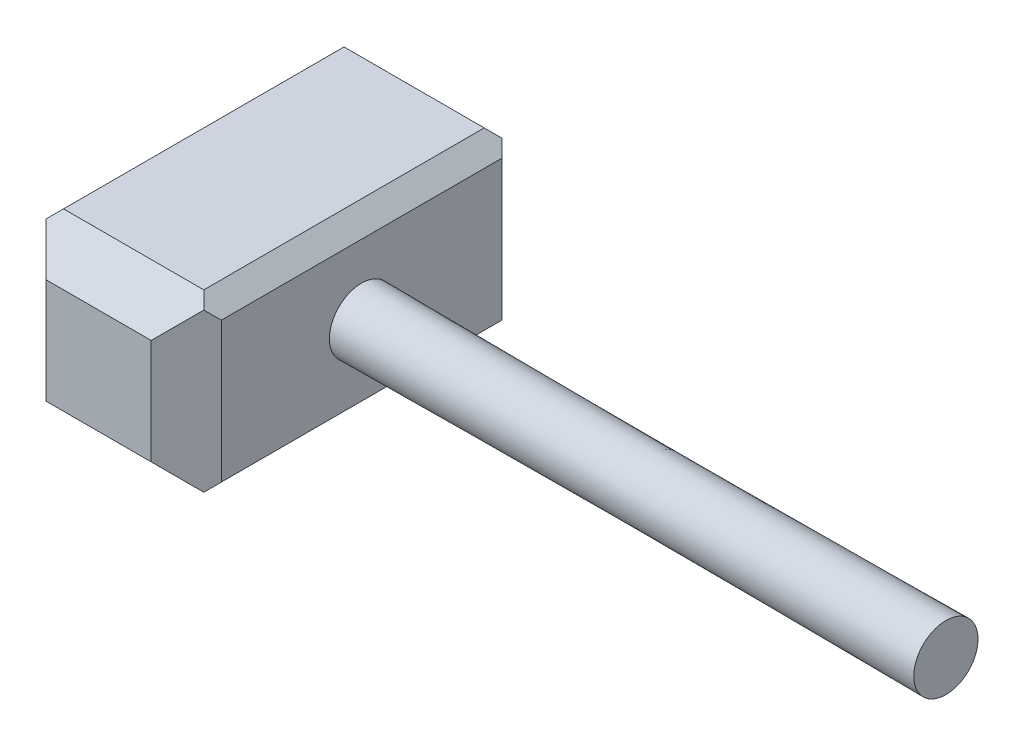
ISO-10303-21;
HEADER;
FILE_DESCRIPTION(('STEP AP214'),'2;1');
FILE_NAME('part.step','',(''),(''),'','','');
FILE_SCHEMA(('AUTOMOTIVE_DESIGN { 1 0 10303 214 1 1 1 1 }'));
ENDSEC;
DATA;
#1=APPLICATION_CONTEXT('core data for automotive mechanical design processes');
#2=APPLICATION_PROTOCOL_DEFINITION('international standard','automotive_design',2000,#1);
#3=PRODUCT_CONTEXT('',#1,'mechanical');
#4=PRODUCT('Part','Part','',(#3));
#5=PRODUCT_RELATED_PRODUCT_CATEGORY('part','',(#4));
#6=PRODUCT_DEFINITION_FORMATION('','',#4);
#7=PRODUCT_DEFINITION_CONTEXT('part definition',#1,'design');
#8=PRODUCT_DEFINITION('design','',#6,#7);
#9=PRODUCT_DEFINITION_SHAPE('','',#8);
#10=(LENGTH_UNIT() NAMED_UNIT(*) SI_UNIT(.MILLI.,.METRE.));
#11=(NAMED_UNIT(*) PLANE_ANGLE_UNIT() SI_UNIT($,.RADIAN.));
#12=(NAMED_UNIT(*) SI_UNIT($,.STERADIAN.) SOLID_ANGLE_UNIT());
#13=UNCERTAINTY_MEASURE_WITH_UNIT(LENGTH_MEASURE(1.E-05),#10,'distance_accuracy_value','');
#14=(GEOMETRIC_REPRESENTATION_CONTEXT(3) GLOBAL_UNCERTAINTY_ASSIGNED_CONTEXT((#13)) GLOBAL_UNIT_ASSIGNED_CONTEXT((#10,
#11,#12)) REPRESENTATION_CONTEXT('',''));
#15=CARTESIAN_POINT('',(0.,0.,0.));
#16=DIRECTION('',(0.,0.,1.));
#17=DIRECTION('',(1.,0.,0.));
#18=AXIS2_PLACEMENT_3D('',#15,#16,#17);
#19=CARTESIAN_POINT('',(150.,0.,0.));
#20=DIRECTION('',(1.,0.,0.));
#21=DIRECTION('',(0.,0.,-1.));
#22=AXIS2_PLACEMENT_3D('',#19,#20,#21);
#23=PLANE('',#22);
#24=DIRECTION('',(0.,1.,0.));
#25=VECTOR('',#24,1.);
#26=CARTESIAN_POINT('',(150.,0.,-120.));
#27=LINE('',#26,#25);
#28=CARTESIAN_POINT('',(150.,-60.0000000000001,-120.));
#29=VERTEX_POINT('',#28);
#30=CARTESIAN_POINT('',(150.,60.0000000000001,-120.));
#31=VERTEX_POINT('',#30);
#32=EDGE_CURVE('E234',#29,#31,#27,.T.);
#33=ORIENTED_EDGE('',*,*,#32,.T.);
#34=DIRECTION('',(0.,0.,1.));
#35=VECTOR('',#34,1.);
#36=CARTESIAN_POINT('',(150.,60.0000000000001,0.));
#37=LINE('',#36,#35);
#38=CARTESIAN_POINT('',(150.,60.0000000000001,120.));
#39=VERTEX_POINT('',#38);
#40=EDGE_CURVE('E239',#31,#39,#37,.T.);
#41=ORIENTED_EDGE('',*,*,#40,.T.);
#42=DIRECTION('',(0.,-1.,0.));
#43=VECTOR('',#42,1.);
#44=CARTESIAN_POINT('',(150.,0.,120.));
#45=LINE('',#44,#43);
#46=CARTESIAN_POINT('',(150.,-60.0000000000001,120.));
#47=VERTEX_POINT('',#46);
#48=EDGE_CURVE('E219',#39,#47,#45,.T.);
#49=ORIENTED_EDGE('',*,*,#48,.T.);
#50=DIRECTION('',(0.,0.,-1.));
#51=VECTOR('',#50,1.);
#52=CARTESIAN_POINT('',(150.,-60.0000000000001,0.));
#53=LINE('',#52,#51);
#54=EDGE_CURVE('E236',#47,#29,#53,.T.);
#55=ORIENTED_EDGE('',*,*,#54,.T.);
#56=EDGE_LOOP('',(#33,#41,#49,#55));
#57=FACE_BOUND('',#56,.T.);
#58=CARTESIAN_POINT('',(150.,0.,0.));
#59=DIRECTION('',(1.,0.,0.));
#60=DIRECTION('',(0.,0.,-1.));
#61=AXIS2_PLACEMENT_3D('',#58,#59,#60);
#62=CIRCLE('',#61,27.5);
#63=CARTESIAN_POINT('',(150.,5.18692748405575,-27.006402634841));
#64=VERTEX_POINT('',#63);
#65=EDGE_CURVE('E363',#64,#64,#62,.T.);
#66=ORIENTED_EDGE('',*,*,#65,.F.);
#67=EDGE_LOOP('',(#66));
#68=FACE_BOUND('',#67,.T.);
#69=ADVANCED_FACE('F54',(#57,#68),#23,.T.);
#70=CARTESIAN_POINT('',(0.,0.,0.));
#71=DIRECTION('',(1.,0.,0.));
#72=DIRECTION('',(0.,0.,-1.));
#73=AXIS2_PLACEMENT_3D('',#70,#71,#72);
#74=PLANE('',#73);
#75=CARTESIAN_POINT('',(0.,0.,0.));
#76=DIRECTION('',(1.,0.,0.));
#77=DIRECTION('',(0.,0.,-1.));
#78=AXIS2_PLACEMENT_3D('',#75,#76,#77);
#79=CIRCLE('',#78,45.);
#80=CARTESIAN_POINT('',(0.,44.9803796654246,1.32870055101058));
#81=VERTEX_POINT('',#80);
#82=EDGE_CURVE('E644',#81,#81,#79,.T.);
#83=ORIENTED_EDGE('',*,*,#82,.T.);
#84=EDGE_LOOP('',(#83));
#85=FACE_BOUND('',#84,.T.);
#86=DIRECTION('',(0.,1.,0.));
#87=VECTOR('',#86,1.);
#88=CARTESIAN_POINT('',(0.,44.9999999999998,120.));
#89=LINE('',#88,#87);
#90=CARTESIAN_POINT('',(0.,-60.,120.));
#91=VERTEX_POINT('',#90);
#92=CARTESIAN_POINT('',(0.,60.,120.));
#93=VERTEX_POINT('',#92);
#94=EDGE_CURVE('E176',#91,#93,#89,.T.);
#95=ORIENTED_EDGE('',*,*,#94,.T.);
#96=DIRECTION('',(0.,0.,-1.));
#97=VECTOR('',#96,1.);
#98=CARTESIAN_POINT('',(0.,60.,-120.));
#99=LINE('',#98,#97);
#100=CARTESIAN_POINT('',(0.,60.,-120.));
#101=VERTEX_POINT('',#100);
#102=EDGE_CURVE('E281',#93,#101,#99,.T.);
#103=ORIENTED_EDGE('',*,*,#102,.T.);
#104=DIRECTION('',(0.,-1.,0.));
#105=VECTOR('',#104,1.);
#106=CARTESIAN_POINT('',(0.,-45.,-120.));
#107=LINE('',#106,#105);
#108=CARTESIAN_POINT('',(0.,-60.,-120.));
#109=VERTEX_POINT('',#108);
#110=EDGE_CURVE('E247',#101,#109,#107,.T.);
#111=ORIENTED_EDGE('',*,*,#110,.T.);
#112=DIRECTION('',(0.,0.,1.));
#113=VECTOR('',#112,1.);
#114=CARTESIAN_POINT('',(0.,-60.,120.));
#115=LINE('',#114,#113);
#116=EDGE_CURVE('E276',#109,#91,#115,.T.);
#117=ORIENTED_EDGE('',*,*,#116,.T.);
#118=EDGE_LOOP('',(#95,#103,#111,#117));
#119=FACE_BOUND('',#118,.T.);
#120=ADVANCED_FACE('F393',(#85,#119),#74,.F.);
#121=CARTESIAN_POINT('',(0.,0.,150.));
#122=DIRECTION('',(0.,0.,1.));
#123=DIRECTION('',(1.,0.,0.));
#124=AXIS2_PLACEMENT_3D('',#121,#122,#123);
#125=PLANE('',#124);
#126=DIRECTION('',(1.,0.,0.));
#127=VECTOR('',#126,1.);
#128=CARTESIAN_POINT('',(0.,-44.9999999999999,150.));
#129=LINE('',#128,#127);
#130=CARTESIAN_POINT('',(30.,-44.9999999999999,150.));
#131=VERTEX_POINT('',#130);
#132=CARTESIAN_POINT('',(120.,-44.9999999999999,150.));
#133=VERTEX_POINT('',#132);
#134=EDGE_CURVE('E182',#131,#133,#129,.T.);
#135=ORIENTED_EDGE('',*,*,#134,.T.);
#136=DIRECTION('',(0.,1.,0.));
#137=VECTOR('',#136,1.);
#138=CARTESIAN_POINT('',(120.,0.,150.));
#139=LINE('',#138,#137);
#140=CARTESIAN_POINT('',(120.,44.9999999999997,150.));
#141=VERTEX_POINT('',#140);
#142=EDGE_CURVE('E246',#133,#141,#139,.T.);
#143=ORIENTED_EDGE('',*,*,#142,.T.);
#144=DIRECTION('',(-1.,0.,0.));
#145=VECTOR('',#144,1.);
#146=CARTESIAN_POINT('',(0.,44.9999999999998,150.));
#147=LINE('',#146,#145);
#148=CARTESIAN_POINT('',(30.,44.9999999999998,150.));
#149=VERTEX_POINT('',#148);
#150=EDGE_CURVE('E185',#141,#149,#147,.T.);
#151=ORIENTED_EDGE('',*,*,#150,.T.);
#152=DIRECTION('',(0.,-1.,0.));
#153=VECTOR('',#152,1.);
#154=CARTESIAN_POINT('',(30.,-44.9999999999999,150.));
#155=LINE('',#154,#153);
#156=EDGE_CURVE('E171',#149,#131,#155,.T.);
#157=ORIENTED_EDGE('',*,*,#156,.T.);
#158=EDGE_LOOP('',(#135,#143,#151,#157));
#159=FACE_BOUND('',#158,.T.);
#160=ADVANCED_FACE('F181',(#159),#125,.T.);
#161=CARTESIAN_POINT('',(0.,-75.,0.));
#162=DIRECTION('',(0.,-1.,0.));
#163=DIRECTION('',(0.,0.,-1.));
#164=AXIS2_PLACEMENT_3D('',#161,#162,#163);
#165=PLANE('',#164);
#166=DIRECTION('',(1.,0.,0.));
#167=VECTOR('',#166,1.);
#168=CARTESIAN_POINT('',(0.,-75.,-120.));
#169=LINE('',#168,#167);
#170=CARTESIAN_POINT('',(15.,-75.,-120.));
#171=VERTEX_POINT('',#170);
#172=CARTESIAN_POINT('',(135.,-75.,-120.));
#173=VERTEX_POINT('',#172);
#174=EDGE_CURVE('E195',#171,#173,#169,.T.);
#175=ORIENTED_EDGE('',*,*,#174,.T.);
#176=DIRECTION('',(0.,0.,1.));
#177=VECTOR('',#176,1.);
#178=CARTESIAN_POINT('',(135.,-75.,0.));
#179=LINE('',#178,#177);
#180=CARTESIAN_POINT('',(135.,-75.,120.));
#181=VERTEX_POINT('',#180);
#182=EDGE_CURVE('E76',#173,#181,#179,.T.);
#183=ORIENTED_EDGE('',*,*,#182,.T.);
#184=DIRECTION('',(-1.,0.,0.));
#185=VECTOR('',#184,1.);
#186=CARTESIAN_POINT('',(0.,-75.,120.));
#187=LINE('',#186,#185);
#188=CARTESIAN_POINT('',(15.,-75.,120.));
#189=VERTEX_POINT('',#188);
#190=EDGE_CURVE('E320',#181,#189,#187,.T.);
#191=ORIENTED_EDGE('',*,*,#190,.T.);
#192=DIRECTION('',(0.,0.,-1.));
#193=VECTOR('',#192,1.);
#194=CARTESIAN_POINT('',(15.,-75.,-120.));
#195=LINE('',#194,#193);
#196=EDGE_CURVE('E311',#189,#171,#195,.T.);
#197=ORIENTED_EDGE('',*,*,#196,.T.);
#198=EDGE_LOOP('',(#175,#183,#191,#197));
#199=FACE_BOUND('',#198,.T.);
#200=ADVANCED_FACE('F396',(#199),#165,.T.);
#201=CARTESIAN_POINT('',(0.,75.,0.));
#202=DIRECTION('',(0.,1.,0.));
#203=DIRECTION('',(-1.,0.,0.));
#204=AXIS2_PLACEMENT_3D('',#201,#202,#203);
#205=PLANE('',#204);
#206=DIRECTION('',(-1.,0.,0.));
#207=VECTOR('',#206,1.);
#208=CARTESIAN_POINT('',(0.,75.,-120.));
#209=LINE('',#208,#207);
#210=CARTESIAN_POINT('',(135.,75.,-120.));
#211=VERTEX_POINT('',#210);
#212=CARTESIAN_POINT('',(15.,75.,-120.));
#213=VERTEX_POINT('',#212);
#214=EDGE_CURVE('E186',#211,#213,#209,.T.);
#215=ORIENTED_EDGE('',*,*,#214,.T.);
#216=DIRECTION('',(0.,0.,1.));
#217=VECTOR('',#216,1.);
#218=CARTESIAN_POINT('',(15.,75.,120.));
#219=LINE('',#218,#217);
#220=CARTESIAN_POINT('',(15.,75.,120.));
#221=VERTEX_POINT('',#220);
#222=EDGE_CURVE('E211',#213,#221,#219,.T.);
#223=ORIENTED_EDGE('',*,*,#222,.T.);
#224=DIRECTION('',(1.,0.,0.));
#225=VECTOR('',#224,1.);
#226=CARTESIAN_POINT('',(0.,75.,120.));
#227=LINE('',#226,#225);
#228=CARTESIAN_POINT('',(135.,75.,120.));
#229=VERTEX_POINT('',#228);
#230=EDGE_CURVE('E191',#221,#229,#227,.T.);
#231=ORIENTED_EDGE('',*,*,#230,.T.);
#232=DIRECTION('',(0.,0.,-1.));
#233=VECTOR('',#232,1.);
#234=CARTESIAN_POINT('',(135.,75.,0.));
#235=LINE('',#234,#233);
#236=EDGE_CURVE('E209',#229,#211,#235,.T.);
#237=ORIENTED_EDGE('',*,*,#236,.T.);
#238=EDGE_LOOP('',(#215,#223,#231,#237));
#239=FACE_BOUND('',#238,.T.);
#240=ADVANCED_FACE('F399',(#239),#205,.T.);
#241=CARTESIAN_POINT('',(0.,0.,-150.));
#242=DIRECTION('',(0.,0.,-1.));
#243=DIRECTION('',(0.,1.,0.));
#244=AXIS2_PLACEMENT_3D('',#241,#242,#243);
#245=PLANE('',#244);
#246=DIRECTION('',(1.,0.,0.));
#247=VECTOR('',#246,1.);
#248=CARTESIAN_POINT('',(0.,44.9999999999999,-150.));
#249=LINE('',#248,#247);
#250=CARTESIAN_POINT('',(30.0000000000001,44.9999999999999,-150.));
#251=VERTEX_POINT('',#250);
#252=CARTESIAN_POINT('',(120.,44.9999999999998,-150.));
#253=VERTEX_POINT('',#252);
#254=EDGE_CURVE('E358',#251,#253,#249,.T.);
#255=ORIENTED_EDGE('',*,*,#254,.T.);
#256=DIRECTION('',(0.,-1.,0.));
#257=VECTOR('',#256,1.);
#258=CARTESIAN_POINT('',(120.,0.,-150.));
#259=LINE('',#258,#257);
#260=CARTESIAN_POINT('',(120.,-45.,-150.));
#261=VERTEX_POINT('',#260);
#262=EDGE_CURVE('E287',#253,#261,#259,.T.);
#263=ORIENTED_EDGE('',*,*,#262,.T.);
#264=DIRECTION('',(-1.,0.,0.));
#265=VECTOR('',#264,1.);
#266=CARTESIAN_POINT('',(0.,-45.,-150.));
#267=LINE('',#266,#265);
#268=CARTESIAN_POINT('',(30.0000000000001,-45.,-150.));
#269=VERTEX_POINT('',#268);
#270=EDGE_CURVE('E303',#261,#269,#267,.T.);
#271=ORIENTED_EDGE('',*,*,#270,.T.);
#272=DIRECTION('',(0.,1.,0.));
#273=VECTOR('',#272,1.);
#274=CARTESIAN_POINT('',(30.0000000000001,44.9999999999999,-150.));
#275=LINE('',#274,#273);
#276=EDGE_CURVE('E345',#269,#251,#275,.T.);
#277=ORIENTED_EDGE('',*,*,#276,.T.);
#278=EDGE_LOOP('',(#255,#263,#271,#277));
#279=FACE_BOUND('',#278,.T.);
#280=ADVANCED_FACE('F385',(#279),#245,.T.);
#281=CARTESIAN_POINT('',(650.,0.,0.));
#282=DIRECTION('',(1.,0.,0.));
#283=DIRECTION('',(0.,0.,-1.));
#284=AXIS2_PLACEMENT_3D('',#281,#282,#283);
#285=PLANE('',#284);
#286=CARTESIAN_POINT('',(650.,0.,0.));
#287=DIRECTION('',(1.,0.,0.));
#288=DIRECTION('',(0.,0.,-1.));
#289=AXIS2_PLACEMENT_3D('',#286,#287,#288);
#290=CIRCLE('',#289,27.5);
#291=CARTESIAN_POINT('',(650.,19.5793681799474,-19.3105759021854));
#292=VERTEX_POINT('',#291);
#293=EDGE_CURVE('E361',#292,#292,#290,.T.);
#294=ORIENTED_EDGE('',*,*,#293,.T.);
#295=EDGE_LOOP('',(#294));
#296=FACE_BOUND('',#295,.T.);
#297=ADVANCED_FACE('F374',(#296),#285,.T.);
#298=CARTESIAN_POINT('',(150.,5.18692748405575,-27.006402634841));
#299=CARTESIAN_POINT('',(650.,19.5793681799474,-19.3105759021854));
#300=CARTESIAN_POINT('',(150.,59.1997327537378,-16.6325476667295));
#301=CARTESIAN_POINT('',(650.,58.2005199843182,19.8481604577095));
#302=CARTESIAN_POINT('',(150.,48.8258777856263,37.3802576029525));
#303=CARTESIAN_POINT('',(650.,19.0417836244233,58.4693122620802));
#304=CARTESIAN_POINT('',(150.,-5.18692748405575,27.006402634841));
#305=CARTESIAN_POINT('',(650.,-19.5793681799474,19.3105759021854));
#306=CARTESIAN_POINT('',(150.,-59.1997327537378,16.6325476667295));
#307=CARTESIAN_POINT('',(650.,-58.2005199843181,-19.8481604577095));
#308=CARTESIAN_POINT('',(150.,-48.8258777856262,-37.3802576029525));
#309=CARTESIAN_POINT('',(650.,-19.0417836244233,-58.4693122620802));
#310=CARTESIAN_POINT('',(150.,5.18692748405575,-27.006402634841));
#311=CARTESIAN_POINT('',(650.,19.5793681799474,-19.3105759021854));
#312=(BOUNDED_SURFACE() B_SPLINE_SURFACE(3,1,((#298,#299),(#300,#301),(#302,#303),(#304,#305),
(#306,#307),(#308,#309),(#310,#311)),.UNSPECIFIED.,.T.,.F.,.F.) B_SPLINE_SURFACE_WITH_KNOTS((4,
3,4),(2,2),(0.,0.5,1.),(0.,1.),
.UNSPECIFIED.) GEOMETRIC_REPRESENTATION_ITEM() RATIONAL_B_SPLINE_SURFACE(((1.,1.),
(0.333333333333333,0.333333333333333),(0.333333333333333,0.333333333333333),(1.,1.),
(0.333333333333333,0.333333333333334),(0.333333333333333,0.333333333333334),(1.,1.))) REPRESENTATION_ITEM('') SURFACE());
#313=CARTESIAN_POINT('',(150.,5.18692748405575,-27.006402634841));
#314=CARTESIAN_POINT('',(155.208333333333,5.33684874130462,-26.9262377730425));
#315=CARTESIAN_POINT('',(160.416666666667,5.4867699985535,-26.846072911244));
#316=CARTESIAN_POINT('',(170.833333333333,5.78661251305124,-26.685743187647));
#317=CARTESIAN_POINT('',(176.041666666667,5.93653377030011,-26.6055783258485));
#318=CARTESIAN_POINT('',(186.458333333333,6.23637628479785,-26.4452486022515));
#319=CARTESIAN_POINT('',(191.666666666667,6.38629754204673,-26.365083740453));
#320=CARTESIAN_POINT('',(202.083333333333,6.68614005654447,-26.204754016856));
#321=CARTESIAN_POINT('',(207.291666666667,6.83606131379334,-26.1245891550575));
#322=CARTESIAN_POINT('',(217.708333333333,7.13590382829108,-25.9642594314606));
#323=CARTESIAN_POINT('',(222.916666666667,7.28582508553996,-25.8840945696621));
#324=CARTESIAN_POINT('',(233.333333333333,7.5856676000377,-25.7237648460651));
#325=CARTESIAN_POINT('',(238.541666666667,7.73558885728657,-25.6435999842666));
#326=CARTESIAN_POINT('',(248.958333333333,8.03543137178431,-25.4832702606696));
#327=CARTESIAN_POINT('',(254.166666666667,8.18535262903319,-25.4031053988711));
#328=CARTESIAN_POINT('',(264.583333333333,8.48519514353093,-25.2427756752741));
#329=CARTESIAN_POINT('',(269.791666666667,8.6351164007798,-25.1626108134756));
#330=CARTESIAN_POINT('',(280.208333333333,8.93495891527754,-25.0022810898786));
#331=CARTESIAN_POINT('',(285.416666666667,9.08488017252641,-24.9221162280801));
#332=CARTESIAN_POINT('',(295.833333333333,9.38472268702416,-24.7617865044831));
#333=CARTESIAN_POINT('',(301.041666666667,9.53464394427303,-24.6816216426846));
#334=CARTESIAN_POINT('',(311.458333333333,9.83448645877077,-24.5212919190876));
#335=CARTESIAN_POINT('',(316.666666666667,9.98440771601964,-24.4411270572891));
#336=CARTESIAN_POINT('',(327.083333333333,10.2842502305174,-24.2807973336921));
#337=CARTESIAN_POINT('',(332.291666666667,10.4341714877663,-24.2006324718936));
#338=CARTESIAN_POINT('',(342.708333333333,10.734014002264,-24.0403027482966));
#339=CARTESIAN_POINT('',(347.916666666667,10.8839352595129,-23.9601378864981));
#340=CARTESIAN_POINT('',(358.333333333333,11.1837777740106,-23.7998081629012));
#341=CARTESIAN_POINT('',(363.541666666667,11.3336990312595,-23.7196433011027));
#342=CARTESIAN_POINT('',(373.958333333333,11.6335415457572,-23.5593135775057));
#343=CARTESIAN_POINT('',(379.166666666667,11.7834628030061,-23.4791487157072));
#344=CARTESIAN_POINT('',(389.583333333333,12.0833053175038,-23.3188189921102));
#345=CARTESIAN_POINT('',(394.791666666667,12.2332265747527,-23.2386541303117));
#346=CARTESIAN_POINT('',(405.208333333333,12.5330690892505,-23.0783244067147));
#347=CARTESIAN_POINT('',(410.416666666667,12.6829903464993,-22.9981595449162));
#348=CARTESIAN_POINT('',(420.833333333333,12.9828328609971,-22.8378298213192));
#349=CARTESIAN_POINT('',(426.041666666667,13.132754118246,-22.7576649595207));
#350=CARTESIAN_POINT('',(436.458333333333,13.4325966327437,-22.5973352359237));
#351=CARTESIAN_POINT('',(441.666666666667,13.5825178899926,-22.5171703741252));
#352=CARTESIAN_POINT('',(452.083333333333,13.8823604044903,-22.3568406505282));
#353=CARTESIAN_POINT('',(457.291666666667,14.0322816617392,-22.2766757887297));
#354=CARTESIAN_POINT('',(467.708333333333,14.3321241762369,-22.1163460651327));
#355=CARTESIAN_POINT('',(472.916666666667,14.4820454334858,-22.0361812033342));
#356=CARTESIAN_POINT('',(483.333333333333,14.7818879479835,-21.8758514797372));
#357=CARTESIAN_POINT('',(488.541666666667,14.9318092052324,-21.7956866179387));
#358=CARTESIAN_POINT('',(498.958333333333,15.2316517197302,-21.6353568943418));
#359=CARTESIAN_POINT('',(504.166666666667,15.381572976979,-21.5551920325433));
#360=CARTESIAN_POINT('',(514.583333333333,15.6814154914768,-21.3948623089463));
#361=CARTESIAN_POINT('',(519.791666666667,15.8313367487256,-21.3146974471478));
#362=CARTESIAN_POINT('',(530.208333333333,16.1311792632234,-21.1543677235508));
#363=CARTESIAN_POINT('',(535.416666666667,16.2811005204723,-21.0742028617523));
#364=CARTESIAN_POINT('',(545.833333333333,16.58094303497,-20.9138731381553));
#365=CARTESIAN_POINT('',(551.041666666667,16.7308642922189,-20.8337082763568));
#366=CARTESIAN_POINT('',(561.458333333333,17.0307068067166,-20.6733785527598));
#367=CARTESIAN_POINT('',(566.666666666667,17.1806280639655,-20.5932136909613));
#368=CARTESIAN_POINT('',(577.083333333333,17.4804705784632,-20.4328839673643));
#369=CARTESIAN_POINT('',(582.291666666667,17.6303918357121,-20.3527191055658));
#370=CARTESIAN_POINT('',(592.708333333333,17.9302343502098,-20.1923893819688));
#371=CARTESIAN_POINT('',(597.916666666667,18.0801556074587,-20.1122245201703));
#372=CARTESIAN_POINT('',(608.333333333333,18.3799981219565,-19.9518947965733));
#373=CARTESIAN_POINT('',(613.541666666667,18.5299193792053,-19.8717299347748));
#374=CARTESIAN_POINT('',(623.958333333333,18.8297618937031,-19.7114002111778));
#375=CARTESIAN_POINT('',(629.166666666667,18.9796831509519,-19.6312353493793));
#376=CARTESIAN_POINT('',(639.583333333333,19.2795256654497,-19.4709056257824));
#377=CARTESIAN_POINT('',(644.791666666667,19.4294469226986,-19.3907407639839));
#378=CARTESIAN_POINT('',(650.,19.5793681799474,-19.3105759021854));
#379=B_SPLINE_CURVE_WITH_KNOTS('',3,(#313,#314,#315,#316,#317,#318,#319,#320,#321,#322,#323,
#324,#325,#326,#327,#328,#329,#330,#331,#332,#333,#334,#335,#336,#337,#338,#339,#340,#341,#342,
#343,#344,#345,#346,#347,#348,#349,#350,#351,#352,#353,#354,#355,#356,#357,#358,#359,#360,#361,
#362,#363,#364,#365,#366,#367,#368,#369,#370,#371,#372,#373,#374,#375,#376,#377,#378),
.UNSPECIFIED.,.F.,.F.,(4,2,2,2,2,2,2,2,2,2,2,2,2,2,2,2,2,2,2,2,2,2,2,2,2,2,2,2,2,2,2,2,4),(0.,
15.6333217870029,31.2666435740058,46.8999653610088,62.5332871480117,78.1666089350146,
93.7999307220176,109.433252509021,125.066574296023,140.699896083026,156.333217870029,
171.966539657032,187.599861444035,203.233183231038,218.866505018041,234.499826805044,
250.133148592047,265.76647037905,281.399792166053,297.033113953055,312.666435740058,
328.299757527061,343.933079314064,359.566401101067,375.19972288807,390.833044675073,
406.466366462076,422.099688249079,437.733010036082,453.366331823085,468.999653610088,
484.632975397091,500.266297184094),.UNSPECIFIED.);
#380=EDGE_CURVE('BSEAM384',#64,#292,#379,.T.);
#381=ORIENTED_EDGE('',*,*,#65,.T.);
#382=ORIENTED_EDGE('',*,*,#293,.F.);
#383=ORIENTED_EDGE('',*,*,#380,.T.);
#384=ORIENTED_EDGE('',*,*,#380,.F.);
#385=EDGE_LOOP('',(#381,#383,#382,#384));
#386=FACE_BOUND('',#385,.T.);
#387=ADVANCED_FACE('F384',(#386),#312,.T.);
#388=CARTESIAN_POINT('',(-10.,0.,0.));
#389=DIRECTION('',(1.,0.,0.));
#390=DIRECTION('',(0.,0.,-1.));
#391=AXIS2_PLACEMENT_3D('',#388,#389,#390);
#392=PLANE('',#391);
#393=CARTESIAN_POINT('',(-10.,0.,0.));
#394=DIRECTION('',(1.,0.,0.));
#395=DIRECTION('',(0.,0.,-1.));
#396=AXIS2_PLACEMENT_3D('',#393,#394,#395);
#397=CIRCLE('',#396,45.);
#398=CARTESIAN_POINT('',(-10.,44.48507220318,-6.78810364371846));
#399=VERTEX_POINT('',#398);
#400=EDGE_CURVE('E642',#399,#399,#397,.T.);
#401=ORIENTED_EDGE('',*,*,#400,.F.);
#402=EDGE_LOOP('',(#401));
#403=FACE_BOUND('',#402,.T.);
#404=ADVANCED_FACE('F596',(#403),#392,.F.);
#405=CARTESIAN_POINT('',(0.,44.9803796654246,1.32870055101058));
#406=CARTESIAN_POINT('',(-10.,44.48507220318,-6.78810364371846));
#407=CARTESIAN_POINT('',(0.,47.6377807674458,-88.6320587798386));
#408=CARTESIAN_POINT('',(-10.,30.9088649157431,-95.7582480500784));
#409=CARTESIAN_POINT('',(0.,-42.3229785634035,-91.2894598818598));
#410=CARTESIAN_POINT('',(-10.,-58.0612794906169,-82.1820407626415));
#411=CARTESIAN_POINT('',(0.,-44.9803796654246,-1.32870055101058));
#412=CARTESIAN_POINT('',(-10.,-44.48507220318,6.78810364371846));
#413=CARTESIAN_POINT('',(0.,-47.6377807674458,88.6320587798387));
#414=CARTESIAN_POINT('',(-10.,-30.9088649157431,95.7582480500784));
#415=CARTESIAN_POINT('',(0.,42.3229785634035,91.2894598818598));
#416=CARTESIAN_POINT('',(-10.,58.0612794906169,82.1820407626415));
#417=CARTESIAN_POINT('',(0.,44.9803796654246,1.32870055101058));
#418=CARTESIAN_POINT('',(-10.,44.48507220318,-6.78810364371846));
#419=(BOUNDED_SURFACE() B_SPLINE_SURFACE(3,1,((#405,#406),(#407,#408),(#409,#410),(#411,#412),
(#413,#414),(#415,#416),(#417,#418)),.UNSPECIFIED.,.T.,.F.,.F.) B_SPLINE_SURFACE_WITH_KNOTS((4,
3,4),(2,2),(0.,0.5,1.),(0.,1.),
.UNSPECIFIED.) GEOMETRIC_REPRESENTATION_ITEM() RATIONAL_B_SPLINE_SURFACE(((1.,1.),
(0.333333333333333,0.333333333333333),(0.333333333333333,0.333333333333333),(1.,1.),
(0.333333333333333,0.333333333333333),(0.333333333333333,0.333333333333333),(1.,1.))) REPRESENTATION_ITEM('') SURFACE());
#420=CARTESIAN_POINT('',(0.,44.9803796654246,1.32870055101058));
#421=CARTESIAN_POINT('',(-0.104166666666667,44.9752202126929,1.24415050731549));
#422=CARTESIAN_POINT('',(-0.208333333333333,44.9700607599612,1.15960046362039));
#423=CARTESIAN_POINT('',(-0.416666666666667,44.9597418544978,0.990500376230205));
#424=CARTESIAN_POINT('',(-0.520833333333333,44.954582401766,0.905950332535111));
#425=CARTESIAN_POINT('',(-0.729166666666667,44.9442634963026,0.736850245144923));
#426=CARTESIAN_POINT('',(-0.833333333333333,44.9391040435709,0.652300201449828));
#427=CARTESIAN_POINT('',(-1.04166666666667,44.9287851381075,0.48320011405964));
#428=CARTESIAN_POINT('',(-1.14583333333333,44.9236256853758,0.398650070364546));
#429=CARTESIAN_POINT('',(-1.35416666666667,44.9133067799123,0.229549982974358));
#430=CARTESIAN_POINT('',(-1.45833333333333,44.9081473271806,0.144999939279264));
#431=CARTESIAN_POINT('',(-1.66666666666667,44.8978284217172,-0.0241001481109249));
#432=CARTESIAN_POINT('',(-1.77083333333333,44.8926689689855,-0.108650191806019));
#433=CARTESIAN_POINT('',(-1.97916666666667,44.882350063522,-0.277750279196208));
#434=CARTESIAN_POINT('',(-2.08333333333333,44.8771906107903,-0.362300322891302));
#435=CARTESIAN_POINT('',(-2.29166666666667,44.8668717053269,-0.53140041028149));
#436=CARTESIAN_POINT('',(-2.39583333333333,44.8617122525952,-0.615950453976584));
#437=CARTESIAN_POINT('',(-2.60416666666667,44.8513933471317,-0.785050541366773));
#438=CARTESIAN_POINT('',(-2.70833333333333,44.8462338944,-0.869600585061867));
#439=CARTESIAN_POINT('',(-2.91666666666667,44.8359149889366,-1.03870067245205));
#440=CARTESIAN_POINT('',(-3.02083333333333,44.8307555362049,-1.12325071614715));
#441=CARTESIAN_POINT('',(-3.22916666666667,44.8204366307415,-1.29235080353734));
#442=CARTESIAN_POINT('',(-3.33333333333333,44.8152771780097,-1.37690084723243));
#443=CARTESIAN_POINT('',(-3.54166666666667,44.8049582725463,-1.54600093462262));
#444=CARTESIAN_POINT('',(-3.64583333333333,44.7997988198146,-1.63055097831771));
#445=CARTESIAN_POINT('',(-3.85416666666667,44.7894799143512,-1.7996510657079));
#446=CARTESIAN_POINT('',(-3.95833333333333,44.7843204616194,-1.884201109403));
#447=CARTESIAN_POINT('',(-4.16666666666667,44.774001556156,-2.05330119679319));
#448=CARTESIAN_POINT('',(-4.27083333333333,44.7688421034243,-2.13785124048828));
#449=CARTESIAN_POINT('',(-4.47916666666667,44.7585231979609,-2.30695132787847));
#450=CARTESIAN_POINT('',(-4.58333333333333,44.7533637452292,-2.39150137157356));
#451=CARTESIAN_POINT('',(-4.79166666666667,44.7430448397657,-2.56060145896375));
#452=CARTESIAN_POINT('',(-4.89583333333333,44.737885387034,-2.64515150265884));
#453=CARTESIAN_POINT('',(-5.10416666666667,44.7275664815706,-2.81425159004903));
#454=CARTESIAN_POINT('',(-5.20833333333333,44.7224070288389,-2.89880163374413));
#455=CARTESIAN_POINT('',(-5.41666666666667,44.7120881233754,-3.06790172113431));
#456=CARTESIAN_POINT('',(-5.52083333333333,44.7069286706437,-3.15245176482941));
#457=CARTESIAN_POINT('',(-5.72916666666667,44.6966097651803,-3.3215518522196));
#458=CARTESIAN_POINT('',(-5.83333333333333,44.6914503124486,-3.40610189591469));
#459=CARTESIAN_POINT('',(-6.04166666666667,44.6811314069852,-3.57520198330488));
#460=CARTESIAN_POINT('',(-6.14583333333333,44.6759719542534,-3.65975202699997));
#461=CARTESIAN_POINT('',(-6.35416666666667,44.66565304879,-3.82885211439016));
#462=CARTESIAN_POINT('',(-6.45833333333333,44.6604935960583,-3.91340215808526));
#463=CARTESIAN_POINT('',(-6.66666666666667,44.6501746905949,-4.08250224547545));
#464=CARTESIAN_POINT('',(-6.77083333333333,44.6450152378631,-4.16705228917054));
#465=CARTESIAN_POINT('',(-6.97916666666667,44.6346963323997,-4.33615237656073));
#466=CARTESIAN_POINT('',(-7.08333333333333,44.629536879668,-4.42070242025582));
#467=CARTESIAN_POINT('',(-7.29166666666667,44.6192179742046,-4.58980250764601));
#468=CARTESIAN_POINT('',(-7.39583333333333,44.6140585214729,-4.6743525513411));
#469=CARTESIAN_POINT('',(-7.60416666666667,44.6037396160094,-4.84345263873129));
#470=CARTESIAN_POINT('',(-7.70833333333333,44.5985801632777,-4.92800268242639));
#471=CARTESIAN_POINT('',(-7.91666666666667,44.5882612578143,-5.09710276981658));
#472=CARTESIAN_POINT('',(-8.02083333333333,44.5831018050826,-5.18165281351167));
#473=CARTESIAN_POINT('',(-8.22916666666667,44.5727828996191,-5.35075290090186));
#474=CARTESIAN_POINT('',(-8.33333333333333,44.5676234468874,-5.43530294459695));
#475=CARTESIAN_POINT('',(-8.54166666666667,44.557304541424,-5.60440303198714));
#476=CARTESIAN_POINT('',(-8.64583333333333,44.5521450886923,-5.68895307568224));
#477=CARTESIAN_POINT('',(-8.85416666666667,44.5418261832288,-5.85805316307242));
#478=CARTESIAN_POINT('',(-8.95833333333333,44.5366667304971,-5.94260320676752));
#479=CARTESIAN_POINT('',(-9.16666666666667,44.5263478250337,-6.11170329415771));
#480=CARTESIAN_POINT('',(-9.27083333333333,44.521188372302,-6.1962533378528));
#481=CARTESIAN_POINT('',(-9.47916666666667,44.5108694668386,-6.36535342524299));
#482=CARTESIAN_POINT('',(-9.58333333333333,44.5057100141069,-6.44990346893808));
#483=CARTESIAN_POINT('',(-9.79166666666667,44.4953911086434,-6.61900355632827));
#484=CARTESIAN_POINT('',(-9.89583333333333,44.4902316559117,-6.70355360002336));
#485=CARTESIAN_POINT('',(-10.,44.48507220318,-6.78810364371846));
#486=B_SPLINE_CURVE_WITH_KNOTS('',3,(#420,#421,#422,#423,#424,#425,#426,#427,#428,#429,#430,
#431,#432,#433,#434,#435,#436,#437,#438,#439,#440,#441,#442,#443,#444,#445,#446,#447,#448,#449,
#450,#451,#452,#453,#454,#455,#456,#457,#458,#459,#460,#461,#462,#463,#464,#465,#466,#467,#468,
#469,#470,#471,#472,#473,#474,#475,#476,#477,#478,#479,#480,#481,#482,#483,#484,#485),
.UNSPECIFIED.,.F.,.F.,(4,2,2,2,2,2,2,2,2,2,2,2,2,2,2,2,2,2,2,2,2,2,2,2,2,2,2,2,2,2,2,2,4),(0.,
0.402783091219081,0.805566182438161,1.20834927365724,1.61113236487632,2.0139154560954,
2.41669854731448,2.81948163853356,3.22226472975265,3.62504782097173,4.02783091219081,
4.43061400340989,4.83339709462897,5.23618018584805,5.63896327706713,6.04174636828621,
6.44452945950529,6.84731255072437,7.25009564194345,7.65287873316253,8.05566182438161,
8.45844491560069,8.86122800681977,9.26401109803885,9.66679418925793,10.069577280477,
10.4723603716961,10.8751434629152,11.2779265541343,11.6807096453533,12.0834927365724,
12.4862758277915,12.8890589190106),.UNSPECIFIED.);
#487=EDGE_CURVE('BSEAM414',#81,#399,#486,.T.);
#488=ORIENTED_EDGE('',*,*,#82,.F.);
#489=ORIENTED_EDGE('',*,*,#400,.T.);
#490=ORIENTED_EDGE('',*,*,#487,.T.);
#491=ORIENTED_EDGE('',*,*,#487,.F.);
#492=EDGE_LOOP('',(#488,#490,#489,#491));
#493=FACE_BOUND('',#492,.T.);
#494=ADVANCED_FACE('F414',(#493),#419,.T.);
#495=CARTESIAN_POINT('',(0.,-45.,-150.));
#496=DIRECTION('',(0.,0.70710678118655,0.707106781186545));
#497=DIRECTION('',(-1.,0.,0.));
#498=AXIS2_PLACEMENT_3D('',#495,#496,#497);
#499=PLANE('',#498);
#500=DIRECTION('',(0.577350269189629,-0.577350269189622,0.577350269189627));
#501=VECTOR('',#500,1.);
#502=CARTESIAN_POINT('',(79.9999999999996,-5.00000000000002,-190.));
#503=LINE('',#502,#501);
#504=CARTESIAN_POINT('',(142.5,-67.4999999999999,-127.5));
#505=VERTEX_POINT('',#504);
#506=EDGE_CURVE('E279',#261,#505,#503,.T.);
#507=ORIENTED_EDGE('',*,*,#506,.T.);
#508=DIRECTION('',(-0.577350269189627,-0.577350269189623,0.577350269189627));
#509=VECTOR('',#508,1.);
#510=CARTESIAN_POINT('',(110.,-99.9999999999999,-94.9999999999996));
#511=LINE('',#510,#509);
#512=EDGE_CURVE('E301',#505,#173,#511,.T.);
#513=ORIENTED_EDGE('',*,*,#512,.T.);
#514=ORIENTED_EDGE('',*,*,#174,.F.);
#515=DIRECTION('',(0.577350269189624,-0.577350269189624,0.577350269189629));
#516=VECTOR('',#515,1.);
#517=CARTESIAN_POINT('',(-10.,-49.9999999999999,-145.));
#518=LINE('',#517,#516);
#519=CARTESIAN_POINT('',(7.50000000000002,-67.5,-127.5));
#520=VERTEX_POINT('',#519);
#521=EDGE_CURVE('E312',#171,#520,#518,.F.);
#522=ORIENTED_EDGE('',*,*,#521,.T.);
#523=DIRECTION('',(-0.577350269189626,-0.577350269189623,0.577350269189628));
#524=VECTOR('',#523,1.);
#525=CARTESIAN_POINT('',(20.0000000000001,-55.,-140.));
#526=LINE('',#525,#524);
#527=EDGE_CURVE('E284',#520,#269,#526,.F.);
#528=ORIENTED_EDGE('',*,*,#527,.T.);
#529=ORIENTED_EDGE('',*,*,#270,.F.);
#530=EDGE_LOOP('',(#507,#513,#514,#522,#528,#529));
#531=FACE_BOUND('',#530,.T.);
#532=ADVANCED_FACE('F299',(#531),#499,.F.);
#533=CARTESIAN_POINT('',(0.,-75.,120.));
#534=DIRECTION('',(0.,0.707106781186545,-0.70710678118655));
#535=DIRECTION('',(-1.,0.,0.));
#536=AXIS2_PLACEMENT_3D('',#533,#534,#535);
#537=PLANE('',#536);
#538=ORIENTED_EDGE('',*,*,#190,.F.);
#539=DIRECTION('',(0.57735026918963,0.577350269189626,0.577350269189622));
#540=VECTOR('',#539,1.);
#541=CARTESIAN_POINT('',(89.9999999999994,-120.,75.0000000000001));
#542=LINE('',#541,#540);
#543=CARTESIAN_POINT('',(142.5,-67.5,127.5));
#544=VERTEX_POINT('',#543);
#545=EDGE_CURVE('E12',#181,#544,#542,.T.);
#546=ORIENTED_EDGE('',*,*,#545,.T.);
#547=DIRECTION('',(-0.577350269189624,0.577350269189628,0.577350269189625));
#548=VECTOR('',#547,1.);
#549=CARTESIAN_POINT('',(100.,-24.9999999999999,170.));
#550=LINE('',#549,#548);
#551=EDGE_CURVE('E190',#544,#133,#550,.T.);
#552=ORIENTED_EDGE('',*,*,#551,.T.);
#553=ORIENTED_EDGE('',*,*,#134,.F.);
#554=DIRECTION('',(0.577350269189622,0.57735026918963,0.577350269189626));
#555=VECTOR('',#554,1.);
#556=CARTESIAN_POINT('',(0.,-75.,120.));
#557=LINE('',#556,#555);
#558=CARTESIAN_POINT('',(7.49999999999999,-67.4999999999999,127.5));
#559=VERTEX_POINT('',#558);
#560=EDGE_CURVE('E167',#131,#559,#557,.F.);
#561=ORIENTED_EDGE('',*,*,#560,.T.);
#562=DIRECTION('',(-0.577350269189627,0.577350269189627,0.577350269189623));
#563=VECTOR('',#562,1.);
#564=CARTESIAN_POINT('',(10.,-70.,125.));
#565=LINE('',#564,#563);
#566=EDGE_CURVE('E63',#559,#189,#565,.F.);
#567=ORIENTED_EDGE('',*,*,#566,.T.);
#568=EDGE_LOOP('',(#538,#546,#552,#553,#561,#567));
#569=FACE_BOUND('',#568,.T.);
#570=ADVANCED_FACE('F188',(#569),#537,.F.);
#571=CARTESIAN_POINT('',(0.,75.,-120.));
#572=DIRECTION('',(0.,-0.707106781186547,0.707106781186548));
#573=DIRECTION('',(-1.,0.,0.));
#574=AXIS2_PLACEMENT_3D('',#571,#572,#573);
#575=PLANE('',#574);
#576=DIRECTION('',(0.577350269189624,-0.577350269189627,-0.577350269189626));
#577=VECTOR('',#576,1.);
#578=CARTESIAN_POINT('',(0.,75.,-120.));
#579=LINE('',#578,#577);
#580=CARTESIAN_POINT('',(7.5,67.5,-127.5));
#581=VERTEX_POINT('',#580);
#582=EDGE_CURVE('E346',#251,#581,#579,.F.);
#583=ORIENTED_EDGE('',*,*,#582,.T.);
#584=DIRECTION('',(-0.577350269189626,-0.577350269189626,-0.577350269189626));
#585=VECTOR('',#584,1.);
#586=CARTESIAN_POINT('',(10.,70.,-125.));
#587=LINE('',#586,#585);
#588=EDGE_CURVE('E240',#581,#213,#587,.F.);
#589=ORIENTED_EDGE('',*,*,#588,.T.);
#590=ORIENTED_EDGE('',*,*,#214,.F.);
#591=DIRECTION('',(0.577350269189629,-0.577350269189625,-0.577350269189624));
#592=VECTOR('',#591,1.);
#593=CARTESIAN_POINT('',(89.9999999999995,120.,-74.9999999999997));
#594=LINE('',#593,#592);
#595=CARTESIAN_POINT('',(142.5,67.4999999999999,-127.5));
#596=VERTEX_POINT('',#595);
#597=EDGE_CURVE('E338',#211,#596,#594,.T.);
#598=ORIENTED_EDGE('',*,*,#597,.T.);
#599=DIRECTION('',(-0.577350269189627,-0.577350269189625,-0.577350269189625));
#600=VECTOR('',#599,1.);
#601=CARTESIAN_POINT('',(100.,24.9999999999999,-170.));
#602=LINE('',#601,#600);
#603=EDGE_CURVE('E341',#596,#253,#602,.T.);
#604=ORIENTED_EDGE('',*,*,#603,.T.);
#605=ORIENTED_EDGE('',*,*,#254,.F.);
#606=EDGE_LOOP('',(#583,#589,#590,#598,#604,#605));
#607=FACE_BOUND('',#606,.T.);
#608=ADVANCED_FACE('F420',(#607),#575,.F.);
#609=CARTESIAN_POINT('',(0.,44.9999999999998,150.));
#610=DIRECTION('',(0.,-0.707106781186549,-0.707106781186546));
#611=DIRECTION('',(-1.,0.,0.));
#612=AXIS2_PLACEMENT_3D('',#609,#610,#611);
#613=PLANE('',#612);
#614=ORIENTED_EDGE('',*,*,#230,.F.);
#615=DIRECTION('',(0.577350269189625,0.577350269189625,-0.577350269189627));
#616=VECTOR('',#615,1.);
#617=CARTESIAN_POINT('',(-10.0000000000001,49.9999999999999,145.));
#618=LINE('',#617,#616);
#619=CARTESIAN_POINT('',(7.49999999999994,67.4999999999999,127.5));
#620=VERTEX_POINT('',#619);
#621=EDGE_CURVE('E269',#221,#620,#618,.F.);
#622=ORIENTED_EDGE('',*,*,#621,.T.);
#623=DIRECTION('',(-0.577350269189624,0.577350269189626,-0.577350269189628));
#624=VECTOR('',#623,1.);
#625=CARTESIAN_POINT('',(20.0000000000001,54.9999999999997,140.));
#626=LINE('',#625,#624);
#627=EDGE_CURVE('E216',#620,#149,#626,.F.);
#628=ORIENTED_EDGE('',*,*,#627,.T.);
#629=ORIENTED_EDGE('',*,*,#150,.F.);
#630=DIRECTION('',(0.577350269189627,0.577350269189624,-0.577350269189627));
#631=VECTOR('',#630,1.);
#632=CARTESIAN_POINT('',(79.9999999999999,4.99999999999982,190.));
#633=LINE('',#632,#631);
#634=CARTESIAN_POINT('',(142.5,67.4999999999998,127.5));
#635=VERTEX_POINT('',#634);
#636=EDGE_CURVE('E212',#141,#635,#633,.T.);
#637=ORIENTED_EDGE('',*,*,#636,.T.);
#638=DIRECTION('',(-0.577350269189628,0.577350269189624,-0.577350269189625));
#639=VECTOR('',#638,1.);
#640=CARTESIAN_POINT('',(110.,99.9999999999999,94.9999999999997));
#641=LINE('',#640,#639);
#642=EDGE_CURVE('E215',#635,#229,#641,.T.);
#643=ORIENTED_EDGE('',*,*,#642,.T.);
#644=EDGE_LOOP('',(#614,#622,#628,#629,#637,#643));
#645=FACE_BOUND('',#644,.T.);
#646=ADVANCED_FACE('F261',(#645),#613,.F.);
#647=CARTESIAN_POINT('',(30.,0.,150.));
#648=DIRECTION('',(-0.70710678118655,0.,0.707106781186545));
#649=DIRECTION('',(0.,1.,0.));
#650=AXIS2_PLACEMENT_3D('',#647,#648,#649);
#651=PLANE('',#650);
#652=ORIENTED_EDGE('',*,*,#627,.F.);
#653=DIRECTION('',(-0.577350269189624,-0.577350269189624,-0.577350269189629));
#654=VECTOR('',#653,1.);
#655=CARTESIAN_POINT('',(1.42247325030098E-13,60.0000000000002,120.));
#656=LINE('',#655,#654);
#657=EDGE_CURVE('E270',#620,#93,#656,.T.);
#658=ORIENTED_EDGE('',*,*,#657,.T.);
#659=ORIENTED_EDGE('',*,*,#94,.F.);
#660=DIRECTION('',(0.577350269189625,-0.577350269189625,0.577350269189628));
#661=VECTOR('',#660,1.);
#662=CARTESIAN_POINT('',(1.80411241501588E-13,-60.0000000000001,120.));
#663=LINE('',#662,#661);
#664=EDGE_CURVE('E174',#91,#559,#663,.T.);
#665=ORIENTED_EDGE('',*,*,#664,.T.);
#666=ORIENTED_EDGE('',*,*,#560,.F.);
#667=ORIENTED_EDGE('',*,*,#156,.F.);
#668=EDGE_LOOP('',(#652,#658,#659,#665,#666,#667));
#669=FACE_BOUND('',#668,.T.);
#670=ADVANCED_FACE('F170',(#669),#651,.T.);
#671=CARTESIAN_POINT('',(150.,0.,-120.));
#672=DIRECTION('',(-0.707106781186546,0.,0.707106781186549));
#673=DIRECTION('',(0.,1.,0.));
#674=AXIS2_PLACEMENT_3D('',#671,#672,#673);
#675=PLANE('',#674);
#676=ORIENTED_EDGE('',*,*,#603,.F.);
#677=DIRECTION('',(0.577350269189628,-0.577350269189624,0.577350269189626));
#678=VECTOR('',#677,1.);
#679=CARTESIAN_POINT('',(170.,40.0000000000002,-100.));
#680=LINE('',#679,#678);
#681=EDGE_CURVE('E316',#596,#31,#680,.T.);
#682=ORIENTED_EDGE('',*,*,#681,.T.);
#683=ORIENTED_EDGE('',*,*,#32,.F.);
#684=DIRECTION('',(-0.577350269189628,-0.577350269189624,-0.577350269189626));
#685=VECTOR('',#684,1.);
#686=CARTESIAN_POINT('',(170.,-40.0000000000002,-100.));
#687=LINE('',#686,#685);
#688=EDGE_CURVE('E310',#29,#505,#687,.T.);
#689=ORIENTED_EDGE('',*,*,#688,.T.);
#690=ORIENTED_EDGE('',*,*,#506,.F.);
#691=ORIENTED_EDGE('',*,*,#262,.F.);
#692=EDGE_LOOP('',(#676,#682,#683,#689,#690,#691));
#693=FACE_BOUND('',#692,.T.);
#694=ADVANCED_FACE('F340',(#693),#675,.F.);
#695=CARTESIAN_POINT('',(30.0000000000001,0.,-150.));
#696=DIRECTION('',(-0.707106781186549,0.,-0.707106781186546));
#697=DIRECTION('',(0.,-1.,0.));
#698=AXIS2_PLACEMENT_3D('',#695,#696,#697);
#699=PLANE('',#698);
#700=ORIENTED_EDGE('',*,*,#110,.F.);
#701=DIRECTION('',(0.577350269189625,0.577350269189625,-0.577350269189627));
#702=VECTOR('',#701,1.);
#703=CARTESIAN_POINT('',(1.83880688453542E-13,60.0000000000002,-120.));
#704=LINE('',#703,#702);
#705=EDGE_CURVE('E353',#101,#581,#704,.T.);
#706=ORIENTED_EDGE('',*,*,#705,.T.);
#707=ORIENTED_EDGE('',*,*,#582,.F.);
#708=ORIENTED_EDGE('',*,*,#276,.F.);
#709=ORIENTED_EDGE('',*,*,#527,.F.);
#710=DIRECTION('',(-0.577350269189625,0.577350269189625,0.577350269189627));
#711=VECTOR('',#710,1.);
#712=CARTESIAN_POINT('',(1.45716771982052E-13,-60.0000000000001,-120.));
#713=LINE('',#712,#711);
#714=EDGE_CURVE('E283',#520,#109,#713,.T.);
#715=ORIENTED_EDGE('',*,*,#714,.T.);
#716=EDGE_LOOP('',(#700,#706,#707,#708,#709,#715));
#717=FACE_BOUND('',#716,.T.);
#718=ADVANCED_FACE('F441',(#717),#699,.T.);
#719=CARTESIAN_POINT('',(150.,0.,120.));
#720=DIRECTION('',(-0.707106781186548,0.,-0.707106781186547));
#721=DIRECTION('',(0.,-1.,0.));
#722=AXIS2_PLACEMENT_3D('',#719,#720,#721);
#723=PLANE('',#722);
#724=ORIENTED_EDGE('',*,*,#48,.F.);
#725=DIRECTION('',(-0.577350269189627,0.577350269189623,0.577350269189627));
#726=VECTOR('',#725,1.);
#727=CARTESIAN_POINT('',(170.,40.0000000000002,99.9999999999999));
#728=LINE('',#727,#726);
#729=EDGE_CURVE('E268',#39,#635,#728,.T.);
#730=ORIENTED_EDGE('',*,*,#729,.T.);
#731=ORIENTED_EDGE('',*,*,#636,.F.);
#732=ORIENTED_EDGE('',*,*,#142,.F.);
#733=ORIENTED_EDGE('',*,*,#551,.F.);
#734=DIRECTION('',(0.577350269189627,0.577350269189623,-0.577350269189627));
#735=VECTOR('',#734,1.);
#736=CARTESIAN_POINT('',(170.,-40.0000000000003,99.9999999999999));
#737=LINE('',#736,#735);
#738=EDGE_CURVE('E243',#544,#47,#737,.T.);
#739=ORIENTED_EDGE('',*,*,#738,.T.);
#740=EDGE_LOOP('',(#724,#730,#731,#732,#733,#739));
#741=FACE_BOUND('',#740,.T.);
#742=ADVANCED_FACE('F332',(#741),#723,.F.);
#743=CARTESIAN_POINT('',(15.,75.,0.));
#744=DIRECTION('',(-0.707106781186548,0.707106781186548,0.));
#745=DIRECTION('',(0.,0.,-1.));
#746=AXIS2_PLACEMENT_3D('',#743,#744,#745);
#747=PLANE('',#746);
#748=ORIENTED_EDGE('',*,*,#705,.F.);
#749=ORIENTED_EDGE('',*,*,#102,.F.);
#750=ORIENTED_EDGE('',*,*,#657,.F.);
#751=ORIENTED_EDGE('',*,*,#621,.F.);
#752=ORIENTED_EDGE('',*,*,#222,.F.);
#753=ORIENTED_EDGE('',*,*,#588,.F.);
#754=EDGE_LOOP('',(#748,#749,#750,#751,#752,#753));
#755=FACE_BOUND('',#754,.T.);
#756=ADVANCED_FACE('F453',(#755),#747,.T.);
#757=CARTESIAN_POINT('',(150.,60.0000000000001,0.));
#758=DIRECTION('',(-0.707106781186545,-0.70710678118655,0.));
#759=DIRECTION('',(0.,0.,1.));
#760=AXIS2_PLACEMENT_3D('',#757,#758,#759);
#761=PLANE('',#760);
#762=ORIENTED_EDGE('',*,*,#597,.F.);
#763=ORIENTED_EDGE('',*,*,#236,.F.);
#764=ORIENTED_EDGE('',*,*,#642,.F.);
#765=ORIENTED_EDGE('',*,*,#729,.F.);
#766=ORIENTED_EDGE('',*,*,#40,.F.);
#767=ORIENTED_EDGE('',*,*,#681,.F.);
#768=EDGE_LOOP('',(#762,#763,#764,#765,#766,#767));
#769=FACE_BOUND('',#768,.T.);
#770=ADVANCED_FACE('F266',(#769),#761,.F.);
#771=CARTESIAN_POINT('',(150.,-60.0000000000001,0.));
#772=DIRECTION('',(-0.707106781186545,0.70710678118655,0.));
#773=DIRECTION('',(0.,0.,-1.));
#774=AXIS2_PLACEMENT_3D('',#771,#772,#773);
#775=PLANE('',#774);
#776=ORIENTED_EDGE('',*,*,#545,.F.);
#777=ORIENTED_EDGE('',*,*,#182,.F.);
#778=ORIENTED_EDGE('',*,*,#512,.F.);
#779=ORIENTED_EDGE('',*,*,#688,.F.);
#780=ORIENTED_EDGE('',*,*,#54,.F.);
#781=ORIENTED_EDGE('',*,*,#738,.F.);
#782=EDGE_LOOP('',(#776,#777,#778,#779,#780,#781));
#783=FACE_BOUND('',#782,.T.);
#784=ADVANCED_FACE('F308',(#783),#775,.F.);
#785=CARTESIAN_POINT('',(15.,-75.,0.));
#786=DIRECTION('',(-0.707106781186548,-0.707106781186548,0.));
#787=DIRECTION('',(0.,0.,1.));
#788=AXIS2_PLACEMENT_3D('',#785,#786,#787);
#789=PLANE('',#788);
#790=ORIENTED_EDGE('',*,*,#664,.F.);
#791=ORIENTED_EDGE('',*,*,#116,.F.);
#792=ORIENTED_EDGE('',*,*,#714,.F.);
#793=ORIENTED_EDGE('',*,*,#521,.F.);
#794=ORIENTED_EDGE('',*,*,#196,.F.);
#795=ORIENTED_EDGE('',*,*,#566,.F.);
#796=EDGE_LOOP('',(#790,#791,#792,#793,#794,#795));
#797=FACE_BOUND('',#796,.T.);
#798=ADVANCED_FACE('F57',(#797),#789,.T.);
#799=CLOSED_SHELL('',(#69,#120,#160,#200,#240,#280,#297,#387,#404,#494,#532,#570,#608,#646,#670,
#694,#718,#742,#756,#770,#784,#798));
#800=MANIFOLD_SOLID_BREP('B2',#799);
#801=ADVANCED_BREP_SHAPE_REPRESENTATION('',(#18,#800),#14);
#802=SHAPE_DEFINITION_REPRESENTATION(#9,#801);
ENDSEC;
END-ISO-10303-21;
